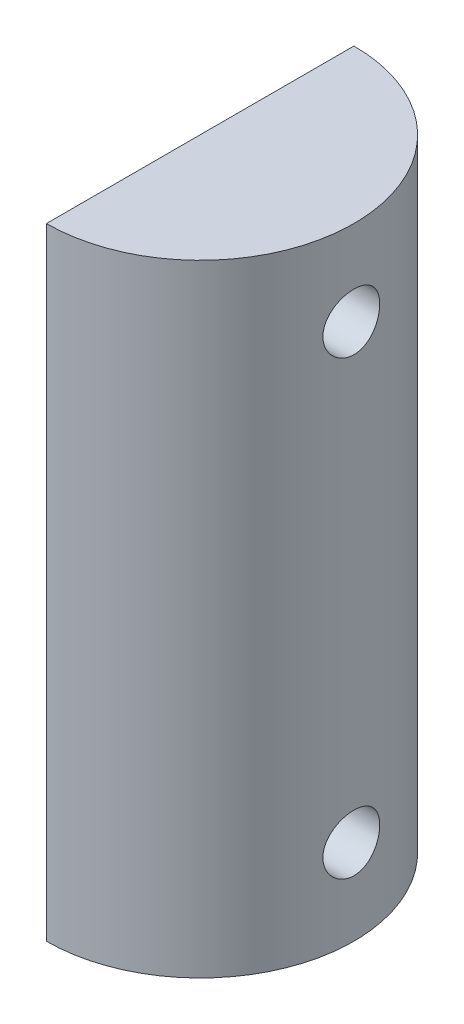
ISO-10303-21;
HEADER;
FILE_DESCRIPTION(('STEP AP214'),'2;1');
FILE_NAME('part.step','',(''),(''),'','','');
FILE_SCHEMA(('AUTOMOTIVE_DESIGN { 1 0 10303 214 1 1 1 1 }'));
ENDSEC;
DATA;
#1=APPLICATION_CONTEXT('core data for automotive mechanical design processes');
#2=APPLICATION_PROTOCOL_DEFINITION('international standard','automotive_design',2000,#1);
#3=PRODUCT_CONTEXT('',#1,'mechanical');
#4=PRODUCT('Part','Part','',(#3));
#5=PRODUCT_RELATED_PRODUCT_CATEGORY('part','',(#4));
#6=PRODUCT_DEFINITION_FORMATION('','',#4);
#7=PRODUCT_DEFINITION_CONTEXT('part definition',#1,'design');
#8=PRODUCT_DEFINITION('design','',#6,#7);
#9=PRODUCT_DEFINITION_SHAPE('','',#8);
#10=(LENGTH_UNIT() NAMED_UNIT(*) SI_UNIT(.MILLI.,.METRE.));
#11=(NAMED_UNIT(*) PLANE_ANGLE_UNIT() SI_UNIT($,.RADIAN.));
#12=(NAMED_UNIT(*) SI_UNIT($,.STERADIAN.) SOLID_ANGLE_UNIT());
#13=UNCERTAINTY_MEASURE_WITH_UNIT(LENGTH_MEASURE(1.E-05),#10,'distance_accuracy_value','');
#14=(GEOMETRIC_REPRESENTATION_CONTEXT(3) GLOBAL_UNCERTAINTY_ASSIGNED_CONTEXT((#13)) GLOBAL_UNIT_ASSIGNED_CONTEXT((#10,
#11,#12)) REPRESENTATION_CONTEXT('',''));
#15=CARTESIAN_POINT('',(0.,0.,0.));
#16=DIRECTION('',(0.,0.,1.));
#17=DIRECTION('',(1.,0.,0.));
#18=AXIS2_PLACEMENT_3D('',#15,#16,#17);
#19=CARTESIAN_POINT('',(0.,-131.3737,0.));
#20=DIRECTION('',(0.,1.,0.));
#21=DIRECTION('',(0.,0.,1.));
#22=AXIS2_PLACEMENT_3D('',#19,#20,#21);
#23=CYLINDRICAL_SURFACE('',#22,32.5);
#24=CARTESIAN_POINT('',(31.9413525073689,-18.,6.));
#25=CARTESIAN_POINT('',(31.9413510155267,-18.1670201057805,6.00000295853529));
#26=CARTESIAN_POINT('',(31.9426650102768,-18.3340018428286,5.99302407715924));
#27=CARTESIAN_POINT('',(31.9478791151134,-18.6668121386166,5.96516856930217));
#28=CARTESIAN_POINT('',(31.9517796989175,-18.8326404804968,5.94428939706712));
#29=CARTESIAN_POINT('',(31.9620573065449,-19.1619925142051,5.88877610738075));
#30=CARTESIAN_POINT('',(31.9684357545158,-19.3255148245342,5.85413407949497));
#31=CARTESIAN_POINT('',(31.9834845406126,-19.6490623611839,5.77135045100128));
#32=CARTESIAN_POINT('',(31.9921557212921,-19.8090862784299,5.72320388723111));
#33=CARTESIAN_POINT('',(32.0115246934935,-20.1242464901465,5.61385452206621));
#34=CARTESIAN_POINT('',(32.0222198341718,-20.2793888715672,5.55266878540925));
#35=CARTESIAN_POINT('',(32.0453420785026,-20.5839936382573,5.41763251250718));
#36=CARTESIAN_POINT('',(32.0577698204828,-20.7334539041662,5.34377730623473));
#37=CARTESIAN_POINT('',(32.0839962627161,-21.0255526297136,5.18398806674357));
#38=CARTESIAN_POINT('',(32.0977943188948,-21.1681942479849,5.09805970034271));
#39=CARTESIAN_POINT('',(32.1263856672193,-21.445828347411,4.91466745622354));
#40=CARTESIAN_POINT('',(32.1411793293463,-21.5808179502543,4.81719927981946));
#41=CARTESIAN_POINT('',(32.1715052735179,-21.8435609962047,4.61034548396163));
#42=CARTESIAN_POINT('',(32.1870436584928,-21.971224083592,4.5008459742891));
#43=CARTESIAN_POINT('',(32.2182832804324,-22.2169465370888,4.27148905640615));
#44=CARTESIAN_POINT('',(32.2339845755935,-22.3350023279637,4.15162782612188));
#45=CARTESIAN_POINT('',(32.2651012097674,-22.5606183411127,3.90243530466569));
#46=CARTESIAN_POINT('',(32.2805166335572,-22.6681817166419,3.77310687922168));
#47=CARTESIAN_POINT('',(32.3106427456994,-22.8721468919223,3.50577559302649));
#48=CARTESIAN_POINT('',(32.3253531722095,-22.9685445631812,3.36776955266252));
#49=CARTESIAN_POINT('',(32.3537527138724,-23.1500886784513,3.08306471017447));
#50=CARTESIAN_POINT('',(32.3674339230622,-23.2351512710868,2.93631162303768));
#51=CARTESIAN_POINT('',(32.3932768150282,-23.3926262624802,2.63597199364875));
#52=CARTESIAN_POINT('',(32.405437928495,-23.4650339257077,2.48238292019941));
#53=CARTESIAN_POINT('',(32.4278825976848,-23.596586679502,2.16955749285647));
#54=CARTESIAN_POINT('',(32.4381669640968,-23.6557374990927,2.01032361299022));
#55=CARTESIAN_POINT('',(32.4565759252547,-23.7603763163272,1.68728985940889));
#56=CARTESIAN_POINT('',(32.4646997333147,-23.805859338139,1.5234883464818));
#57=CARTESIAN_POINT('',(32.4852880303493,-23.9202900315319,1.03085331580681));
#58=CARTESIAN_POINT('',(32.4942588120657,-23.9688604255396,0.696870045496296));
#59=CARTESIAN_POINT('',(32.5017263371873,-24.0093733978569,0.0255664198837325));
#60=CARTESIAN_POINT('',(32.5002239463955,-24.0013206571241,-0.311753657266855));
#61=CARTESIAN_POINT('',(32.4870176310848,-23.9293779268632,-0.97605427828421));
#62=CARTESIAN_POINT('',(32.4754378068713,-23.8661671649283,-1.30311063675733));
#63=CARTESIAN_POINT('',(32.4435119174272,-23.6867559841587,-1.94188038235149));
#64=CARTESIAN_POINT('',(32.4231655399838,-23.5705536780706,-2.25359322258673));
#65=CARTESIAN_POINT('',(32.3757858792464,-23.2878119754776,-2.85482127182886));
#66=CARTESIAN_POINT('',(32.3487165042421,-23.1209997774601,-3.14420524520471));
#67=CARTESIAN_POINT('',(32.2908861364092,-22.7419728723981,-3.69112726413707));
#68=CARTESIAN_POINT('',(32.2601247793352,-22.5297536839487,-3.94866216241415));
#69=CARTESIAN_POINT('',(32.1977799600073,-22.0621897149659,-4.42860067861483));
#70=CARTESIAN_POINT('',(32.1661910748591,-21.8062506004133,-4.65042497033573));
#71=CARTESIAN_POINT('',(32.1061894073334,-21.2604949570635,-5.04808559706013));
#72=CARTESIAN_POINT('',(32.077776668672,-20.970677962086,-5.22392129912474));
#73=CARTESIAN_POINT('',(32.0273370970672,-20.3646393410768,-5.52477115699434));
#74=CARTESIAN_POINT('',(32.0053205950001,-20.0483760495226,-5.64970322536738));
#75=CARTESIAN_POINT('',(31.9703261346543,-19.3988509880879,-5.84449643174312));
#76=CARTESIAN_POINT('',(31.9573471859124,-19.0655910852348,-5.9143636046489));
#77=CARTESIAN_POINT('',(31.9420927158332,-18.3967510158392,-5.99620229168364));
#78=CARTESIAN_POINT('',(31.9396635072359,-18.0612759774973,-6.00900518397556));
#79=CARTESIAN_POINT('',(31.9453725765504,-17.3929810182009,-5.9785785831626));
#80=CARTESIAN_POINT('',(31.9535103486703,-17.0601609709315,-5.93535177193744));
#81=CARTESIAN_POINT('',(31.979293465026,-16.4093432915108,-5.79480586142508));
#82=CARTESIAN_POINT('',(31.9968624934417,-16.0912486424835,-5.69792075735497));
#83=CARTESIAN_POINT('',(32.0394630353324,-15.4758079669587,-5.45326809850266));
#84=CARTESIAN_POINT('',(32.0644950840986,-15.1784634306683,-5.30549689375586));
#85=CARTESIAN_POINT('',(32.1195522144905,-14.6092954141647,-4.96134651750512));
#86=CARTESIAN_POINT('',(32.1496301190139,-14.3377953660428,-4.76444105467971));
#87=CARTESIAN_POINT('',(32.2112404635557,-13.8313897261277,-4.328321885264));
#88=CARTESIAN_POINT('',(32.2427730300079,-13.5964873230619,-4.08910449593802));
#89=CARTESIAN_POINT('',(32.3042327039953,-13.1668487984119,-3.57144762775752));
#90=CARTESIAN_POINT('',(32.3341337897011,-12.9726711361731,-3.29254111714154));
#91=CARTESIAN_POINT('',(32.3885259688709,-12.6339325863055,-2.70556807005942));
#92=CARTESIAN_POINT('',(32.4130172660944,-12.4893698298182,-2.39750263248843));
#93=CARTESIAN_POINT('',(32.453720812997,-12.2548001775852,-1.76258072681928));
#94=CARTESIAN_POINT('',(32.4699750052543,-12.1645164504713,-1.435829080217));
#95=CARTESIAN_POINT('',(32.4925422562138,-12.0402027598243,-0.77128467597163));
#96=CARTESIAN_POINT('',(32.4988563275773,-12.0061670659399,-0.43349304661908));
#97=CARTESIAN_POINT('',(32.5003540565631,-11.9980959848788,0.0710321096354896));
#98=CARTESIAN_POINT('',(32.4995572690841,-12.0023921897452,0.237682638844528));
#99=CARTESIAN_POINT('',(32.495424432952,-12.0248200641111,0.570001473574037));
#100=CARTESIAN_POINT('',(32.4920893427311,-12.0429465114863,0.735670126050066));
#101=CARTESIAN_POINT('',(32.4829668638015,-12.0929088068172,1.06490505616126));
#102=CARTESIAN_POINT('',(32.4771786148997,-12.1247494636854,1.22847057559066));
#103=CARTESIAN_POINT('',(32.4633144843585,-12.2018772460574,1.55224085017754));
#104=CARTESIAN_POINT('',(32.4552394235426,-12.2471595471253,1.71244678909537));
#105=CARTESIAN_POINT('',(32.4370355937856,-12.3507635833937,2.02822736208988));
#106=CARTESIAN_POINT('',(32.4269095551274,-12.4090679939145,2.18380784113108));
#107=CARTESIAN_POINT('',(32.4048786716608,-12.5382959094409,2.48943892302125));
#108=CARTESIAN_POINT('',(32.3929744609303,-12.6092149179221,2.63949147339193));
#109=CARTESIAN_POINT('',(32.3677035827214,-12.7632067767066,2.9331721059094));
#110=CARTESIAN_POINT('',(32.3543363286126,-12.8462845067763,3.07679757825834));
#111=CARTESIAN_POINT('',(32.326510815552,-13.0239579793895,3.35655401432149));
#112=CARTESIAN_POINT('',(32.3120529366048,-13.118549717111,3.49268756010242));
#113=CARTESIAN_POINT('',(32.2822211930687,-13.3200564389901,3.75850222746007));
#114=CARTESIAN_POINT('',(32.2668371982912,-13.427128074562,3.88806348648546));
#115=CARTESIAN_POINT('',(32.2357777361537,-13.6516986066352,4.1376867350828));
#116=CARTESIAN_POINT('',(32.2201023739441,-13.7691937970361,4.25775207244292));
#117=CARTESIAN_POINT('',(32.188881874074,-14.0139179927548,4.48768949162614));
#118=CARTESIAN_POINT('',(32.1733368199346,-14.1411527795317,4.59755543208626));
#119=CARTESIAN_POINT('',(32.1428277311297,-14.4043839559098,4.8062192058397));
#120=CARTESIAN_POINT('',(32.1278634847102,-14.540377103324,4.9050210981696));
#121=CARTESIAN_POINT('',(32.0987973355248,-14.8215537726137,5.09178042683274));
#122=CARTESIAN_POINT('',(32.084704774444,-14.9668111641444,5.17962815718121));
#123=CARTESIAN_POINT('',(32.0579500798171,-15.2642919089007,5.34272083193666));
#124=CARTESIAN_POINT('',(32.0452874201016,-15.4165126706109,5.41797041710961));
#125=CARTESIAN_POINT('',(32.0217661734497,-15.7268057270561,5.55529909721156));
#126=CARTESIAN_POINT('',(32.0109064112641,-15.8848741270677,5.61738677931814));
#127=CARTESIAN_POINT('',(31.9913049603576,-16.2057703702512,5.72796202752485));
#128=CARTESIAN_POINT('',(31.9825628397174,-16.3685972352697,5.7764523672906));
#129=CARTESIAN_POINT('',(31.9640370171761,-16.7725384169445,5.87827970156251));
#130=CARTESIAN_POINT('',(31.9555746068072,-17.0157118039164,5.92386631533028));
#131=CARTESIAN_POINT('',(31.9442335268558,-17.5059514948419,5.98472388662139));
#132=CARTESIAN_POINT('',(31.9413547134423,-17.753017698353,5.99999562504256));
#133=CARTESIAN_POINT('',(31.9413525073689,-18.,6.));
#134=B_SPLINE_CURVE_WITH_KNOTS('',3,(#24,#25,#26,#27,#28,#29,#30,#31,#32,#33,#34,#35,#36,#37,
#38,#39,#40,#41,#42,#43,#44,#45,#46,#47,#48,#49,#50,#51,#52,#53,#54,#55,#56,#57,#58,#59,#60,#61,
#62,#63,#64,#65,#66,#67,#68,#69,#70,#71,#72,#73,#74,#75,#76,#77,#78,#79,#80,#81,#82,#83,#84,#85,
#86,#87,#88,#89,#90,#91,#92,#93,#94,#95,#96,#97,#98,#99,#100,#101,#102,#103,#104,#105,#106,#107,
#108,#109,#110,#111,#112,#113,#114,#115,#116,#117,#118,#119,#120,#121,#122,#123,#124,#125,#126,
#127,#128,#129,#130,#131,#132,#133),.UNSPECIFIED.,.T.,.F.,(4,2,2,2,2,2,2,2,2,2,2,2,2,2,2,2,2,2,
2,2,2,2,2,2,2,2,2,2,2,2,2,2,2,2,2,2,2,2,2,2,2,2,2,2,2,2,2,2,2,2,2,2,2,2,4),(0.,0.50084346333139,
1.00177867835029,1.50300223188231,2.00441023608585,2.50516601956036,3.00610678220385,
3.50681319732149,4.00770672054381,4.51383441416538,5.02014960364326,5.52631215984352,
6.03266127501114,6.54256967053899,7.05266846938636,7.56254639910262,8.07260972824402,
9.08012563787736,10.087558258518,11.082757472296,12.0779921321037,13.0786896815496,
14.0794860395937,15.0951637423725,16.1108554231421,17.128178591491,18.1453902495802,
19.1477325069965,20.1500267887514,21.144330335666,22.1387052169703,23.1442262843942,
24.1498349132333,25.1684425209453,26.1870117562707,27.2003410634462,28.2135671298398,
28.7132031034217,29.2126505140953,29.7122731996682,30.2117167784931,30.7104998117235,
31.2091054067347,31.7079116630686,32.2065449168668,32.7122968113089,33.217869600612,
33.7237448623406,34.2294339227625,34.7398381371698,35.2500539188164,35.7599357905253,
36.269713577754,37.0103588870579,37.7509851174174),.UNSPECIFIED.);
#135=CARTESIAN_POINT('',(31.9413525073689,-18.,6.));
#136=VERTEX_POINT('',#135);
#137=EDGE_CURVE('E72',#136,#136,#134,.T.);
#138=ORIENTED_EDGE('',*,*,#137,.F.);
#139=EDGE_LOOP('',(#138));
#140=FACE_BOUND('',#139,.T.);
#141=CARTESIAN_POINT('',(31.9413525073689,-113.3737,6.));
#142=CARTESIAN_POINT('',(31.9413510155267,-113.540720105781,6.00000295853529));
#143=CARTESIAN_POINT('',(31.9426650102768,-113.707701842829,5.99302407715925));
#144=CARTESIAN_POINT('',(31.9478791151134,-114.040512138617,5.96516856930217));
#145=CARTESIAN_POINT('',(31.9517796989175,-114.206340480497,5.94428939706712));
#146=CARTESIAN_POINT('',(31.9620573065449,-114.535692514205,5.88877610738074));
#147=CARTESIAN_POINT('',(31.9684357545158,-114.699214824534,5.85413407949497));
#148=CARTESIAN_POINT('',(31.9834845406126,-115.022762361184,5.77135045100128));
#149=CARTESIAN_POINT('',(31.9921557212921,-115.18278627843,5.72320388723111));
#150=CARTESIAN_POINT('',(32.0115246934935,-115.497946490147,5.61385452206621));
#151=CARTESIAN_POINT('',(32.0222198341718,-115.653088871567,5.55266878540925));
#152=CARTESIAN_POINT('',(32.0453420785026,-115.957693638257,5.41763251250718));
#153=CARTESIAN_POINT('',(32.0577698204828,-116.107153904166,5.34377730623473));
#154=CARTESIAN_POINT('',(32.0839962627161,-116.399252629714,5.18398806674357));
#155=CARTESIAN_POINT('',(32.0977943188948,-116.541894247985,5.09805970034271));
#156=CARTESIAN_POINT('',(32.1263856672193,-116.819528347411,4.91466745622354));
#157=CARTESIAN_POINT('',(32.1411793293463,-116.954517950254,4.81719927981946));
#158=CARTESIAN_POINT('',(32.1715052735179,-117.217260996205,4.61034548396164));
#159=CARTESIAN_POINT('',(32.1870436584928,-117.344924083592,4.5008459742891));
#160=CARTESIAN_POINT('',(32.2182832804324,-117.590646537089,4.27148905640615));
#161=CARTESIAN_POINT('',(32.2339845755935,-117.708702327964,4.15162782612188));
#162=CARTESIAN_POINT('',(32.2651012097674,-117.934318341113,3.90243530466569));
#163=CARTESIAN_POINT('',(32.2805166335572,-118.041881716642,3.77310687922168));
#164=CARTESIAN_POINT('',(32.3106427456994,-118.245846891922,3.50577559302649));
#165=CARTESIAN_POINT('',(32.3253531722095,-118.342244563181,3.36776955266252));
#166=CARTESIAN_POINT('',(32.3537527138724,-118.523788678451,3.08306471017448));
#167=CARTESIAN_POINT('',(32.3674339230622,-118.608851271087,2.93631162303769));
#168=CARTESIAN_POINT('',(32.3932768150282,-118.76632626248,2.63597199364876));
#169=CARTESIAN_POINT('',(32.405437928495,-118.838733925708,2.48238292019942));
#170=CARTESIAN_POINT('',(32.4278825976848,-118.970286679502,2.16955749285648));
#171=CARTESIAN_POINT('',(32.4381669640968,-119.029437499093,2.01032361299022));
#172=CARTESIAN_POINT('',(32.4565759252547,-119.134076316327,1.6872898594089));
#173=CARTESIAN_POINT('',(32.4646997333147,-119.179559338139,1.5234883464818));
#174=CARTESIAN_POINT('',(32.4852880303492,-119.293990031532,1.03085331580681));
#175=CARTESIAN_POINT('',(32.4942588120657,-119.34256042554,0.6968700454963));
#176=CARTESIAN_POINT('',(32.5017263371873,-119.383073397857,0.0255664198837362));
#177=CARTESIAN_POINT('',(32.5002239463955,-119.375020657124,-0.311753657266851));
#178=CARTESIAN_POINT('',(32.4870176310848,-119.303077926863,-0.976054278284207));
#179=CARTESIAN_POINT('',(32.4754378068713,-119.239867164928,-1.30311063675733));
#180=CARTESIAN_POINT('',(32.4435119174272,-119.060455984159,-1.94188038235149));
#181=CARTESIAN_POINT('',(32.4231655399838,-118.944253678071,-2.25359322258673));
#182=CARTESIAN_POINT('',(32.3757858792464,-118.661511975478,-2.85482127182886));
#183=CARTESIAN_POINT('',(32.3487165042421,-118.49469977746,-3.14420524520471));
#184=CARTESIAN_POINT('',(32.2908861364092,-118.115672872398,-3.69112726413707));
#185=CARTESIAN_POINT('',(32.2601247793352,-117.903453683949,-3.94866216241415));
#186=CARTESIAN_POINT('',(32.1977799600073,-117.435889714966,-4.42860067861483));
#187=CARTESIAN_POINT('',(32.1661910748591,-117.179950600413,-4.65042497033573));
#188=CARTESIAN_POINT('',(32.1061894073334,-116.634194957064,-5.04808559706013));
#189=CARTESIAN_POINT('',(32.077776668672,-116.344377962086,-5.22392129912474));
#190=CARTESIAN_POINT('',(32.0273370970672,-115.738339341077,-5.52477115699434));
#191=CARTESIAN_POINT('',(32.0053205950001,-115.422076049523,-5.64970322536738));
#192=CARTESIAN_POINT('',(31.9703261346543,-114.772550988088,-5.84449643174312));
#193=CARTESIAN_POINT('',(31.9573471859124,-114.439291085235,-5.9143636046489));
#194=CARTESIAN_POINT('',(31.9420927158332,-113.770451015839,-5.99620229168364));
#195=CARTESIAN_POINT('',(31.9396635072359,-113.434975977497,-6.00900518397556));
#196=CARTESIAN_POINT('',(31.9453725765504,-112.766681018201,-5.97857858316261));
#197=CARTESIAN_POINT('',(31.9535103486703,-112.433860970932,-5.93535177193744));
#198=CARTESIAN_POINT('',(31.979293465026,-111.783043291511,-5.79480586142508));
#199=CARTESIAN_POINT('',(31.9968624934417,-111.464948642484,-5.69792075735497));
#200=CARTESIAN_POINT('',(32.0394630353324,-110.849507966959,-5.45326809850266));
#201=CARTESIAN_POINT('',(32.0644950840986,-110.552163430668,-5.30549689375586));
#202=CARTESIAN_POINT('',(32.1195522144905,-109.982995414165,-4.96134651750512));
#203=CARTESIAN_POINT('',(32.1496301190139,-109.711495366043,-4.7644410546797));
#204=CARTESIAN_POINT('',(32.2112404635557,-109.205089726128,-4.328321885264));
#205=CARTESIAN_POINT('',(32.2427730300079,-108.970187323062,-4.08910449593802));
#206=CARTESIAN_POINT('',(32.3042327039953,-108.540548798412,-3.57144762775753));
#207=CARTESIAN_POINT('',(32.3341337897011,-108.346371136173,-3.29254111714154));
#208=CARTESIAN_POINT('',(32.3885259688709,-108.007632586305,-2.70556807005942));
#209=CARTESIAN_POINT('',(32.4130172660944,-107.863069829818,-2.39750263248843));
#210=CARTESIAN_POINT('',(32.453720812997,-107.628500177585,-1.76258072681928));
#211=CARTESIAN_POINT('',(32.4699750052543,-107.538216450471,-1.435829080217));
#212=CARTESIAN_POINT('',(32.4925422562138,-107.413902759824,-0.771284675971633));
#213=CARTESIAN_POINT('',(32.4988563275773,-107.37986706594,-0.433493046619083));
#214=CARTESIAN_POINT('',(32.5003540565631,-107.371795984879,0.0710321096354869));
#215=CARTESIAN_POINT('',(32.4995572690841,-107.376092189745,0.237682638844525));
#216=CARTESIAN_POINT('',(32.495424432952,-107.398520064111,0.570001473574034));
#217=CARTESIAN_POINT('',(32.4920893427311,-107.416646511486,0.735670126050064));
#218=CARTESIAN_POINT('',(32.4829668638015,-107.466608806817,1.06490505616126));
#219=CARTESIAN_POINT('',(32.4771786148997,-107.498449463685,1.22847057559065));
#220=CARTESIAN_POINT('',(32.4633144843585,-107.575577246057,1.55224085017753));
#221=CARTESIAN_POINT('',(32.4552394235426,-107.620859547125,1.71244678909536));
#222=CARTESIAN_POINT('',(32.4370355937856,-107.724463583394,2.02822736208988));
#223=CARTESIAN_POINT('',(32.4269095551274,-107.782767993915,2.18380784113108));
#224=CARTESIAN_POINT('',(32.4048786716608,-107.911995909441,2.48943892302125));
#225=CARTESIAN_POINT('',(32.3929744609303,-107.982914917922,2.63949147339193));
#226=CARTESIAN_POINT('',(32.3677035827214,-108.136906776707,2.9331721059094));
#227=CARTESIAN_POINT('',(32.3543363286126,-108.219984506776,3.07679757825834));
#228=CARTESIAN_POINT('',(32.326510815552,-108.39765797939,3.35655401432149));
#229=CARTESIAN_POINT('',(32.3120529366048,-108.492249717111,3.49268756010242));
#230=CARTESIAN_POINT('',(32.2822211930687,-108.69375643899,3.75850222746007));
#231=CARTESIAN_POINT('',(32.2668371982912,-108.800828074562,3.88806348648546));
#232=CARTESIAN_POINT('',(32.2357777361537,-109.025398606635,4.1376867350828));
#233=CARTESIAN_POINT('',(32.2201023739441,-109.142893797036,4.25775207244293));
#234=CARTESIAN_POINT('',(32.188881874074,-109.387617992755,4.48768949162615));
#235=CARTESIAN_POINT('',(32.1733368199346,-109.514852779532,4.59755543208626));
#236=CARTESIAN_POINT('',(32.1428277311297,-109.77808395591,4.8062192058397));
#237=CARTESIAN_POINT('',(32.1278634847102,-109.914077103324,4.90502109816961));
#238=CARTESIAN_POINT('',(32.0987973355248,-110.195253772614,5.09178042683274));
#239=CARTESIAN_POINT('',(32.084704774444,-110.340511164144,5.17962815718121));
#240=CARTESIAN_POINT('',(32.0579500798171,-110.637991908901,5.34272083193665));
#241=CARTESIAN_POINT('',(32.0452874201016,-110.790212670611,5.4179704171096));
#242=CARTESIAN_POINT('',(32.0217661734497,-111.100505727056,5.55529909721155));
#243=CARTESIAN_POINT('',(32.0109064112641,-111.258574127068,5.61738677931813));
#244=CARTESIAN_POINT('',(31.9913049603576,-111.579470370251,5.72796202752485));
#245=CARTESIAN_POINT('',(31.9825628397174,-111.74229723527,5.77645236729059));
#246=CARTESIAN_POINT('',(31.9640370171761,-112.146238416944,5.87827970156251));
#247=CARTESIAN_POINT('',(31.9555746068072,-112.389411803916,5.92386631533028));
#248=CARTESIAN_POINT('',(31.9442335268558,-112.879651494842,5.98472388662139));
#249=CARTESIAN_POINT('',(31.9413547134423,-113.126717698353,5.99999562504256));
#250=CARTESIAN_POINT('',(31.9413525073689,-113.3737,6.));
#251=B_SPLINE_CURVE_WITH_KNOTS('',3,(#141,#142,#143,#144,#145,#146,#147,#148,#149,#150,#151,
#152,#153,#154,#155,#156,#157,#158,#159,#160,#161,#162,#163,#164,#165,#166,#167,#168,#169,#170,
#171,#172,#173,#174,#175,#176,#177,#178,#179,#180,#181,#182,#183,#184,#185,#186,#187,#188,#189,
#190,#191,#192,#193,#194,#195,#196,#197,#198,#199,#200,#201,#202,#203,#204,#205,#206,#207,#208,
#209,#210,#211,#212,#213,#214,#215,#216,#217,#218,#219,#220,#221,#222,#223,#224,#225,#226,#227,
#228,#229,#230,#231,#232,#233,#234,#235,#236,#237,#238,#239,#240,#241,#242,#243,#244,#245,#246,
#247,#248,#249,#250),.UNSPECIFIED.,.T.,.F.,(4,2,2,2,2,2,2,2,2,2,2,2,2,2,2,2,2,2,2,2,2,2,2,2,2,2,
2,2,2,2,2,2,2,2,2,2,2,2,2,2,2,2,2,2,2,2,2,2,2,2,2,2,2,2,4),(0.,0.500843463331397,
1.0017786783503,1.5030022318823,2.00441023608585,2.50516601956037,3.00610678220385,
3.50681319732149,4.00770672054381,4.51383441416538,5.02014960364326,5.52631215984352,
6.03266127501114,6.54256967053899,7.05266846938635,7.56254639910262,8.07260972824401,
9.08012563787735,10.087558258518,11.0827574722959,12.0779921321037,13.0786896815496,
14.0794860395937,15.0951637423724,16.1108554231421,17.128178591491,18.1453902495802,
19.1477325069965,20.1500267887514,21.144330335666,22.1387052169704,23.1442262843942,
24.1498349132333,25.1684425209453,26.1870117562707,27.2003410634462,28.2135671298398,
28.7132031034217,29.2126505140953,29.7122731996682,30.2117167784931,30.7104998117235,
31.2091054067347,31.7079116630686,32.2065449168668,32.7122968113089,33.217869600612,
33.7237448623406,34.2294339227624,34.7398381371698,35.2500539188164,35.7599357905253,
36.269713577754,37.0103588870579,37.7509851174174),.UNSPECIFIED.);
#252=CARTESIAN_POINT('',(31.9413525073689,-113.3737,6.));
#253=VERTEX_POINT('',#252);
#254=EDGE_CURVE('E86',#253,#253,#251,.T.);
#255=ORIENTED_EDGE('',*,*,#254,.F.);
#256=EDGE_LOOP('',(#255));
#257=FACE_BOUND('',#256,.T.);
#258=CARTESIAN_POINT('',(0.,0.,0.));
#259=DIRECTION('',(0.,1.,0.));
#260=DIRECTION('',(0.,0.,1.));
#261=AXIS2_PLACEMENT_3D('',#258,#259,#260);
#262=CIRCLE('',#261,32.5);
#263=CARTESIAN_POINT('',(0.,0.,32.5));
#264=VERTEX_POINT('',#263);
#265=CARTESIAN_POINT('',(0.,0.,-32.5));
#266=VERTEX_POINT('',#265);
#267=EDGE_CURVE('E70',#264,#266,#262,.T.);
#268=ORIENTED_EDGE('',*,*,#267,.F.);
#269=DIRECTION('',(0.,1.,0.));
#270=VECTOR('',#269,1.);
#271=CARTESIAN_POINT('',(0.,-131.3737,32.5));
#272=LINE('',#271,#270);
#273=CARTESIAN_POINT('',(0.,-131.3737,32.5));
#274=VERTEX_POINT('',#273);
#275=EDGE_CURVE('E11',#274,#264,#272,.T.);
#276=ORIENTED_EDGE('',*,*,#275,.F.);
#277=CARTESIAN_POINT('',(0.,-131.3737,0.));
#278=DIRECTION('',(0.,1.,0.));
#279=DIRECTION('',(0.,0.,1.));
#280=AXIS2_PLACEMENT_3D('',#277,#278,#279);
#281=CIRCLE('',#280,32.5);
#282=CARTESIAN_POINT('',(0.,-131.3737,-32.5));
#283=VERTEX_POINT('',#282);
#284=EDGE_CURVE('E75',#274,#283,#281,.T.);
#285=ORIENTED_EDGE('',*,*,#284,.T.);
#286=DIRECTION('',(0.,1.,0.));
#287=VECTOR('',#286,1.);
#288=CARTESIAN_POINT('',(0.,-131.3737,-32.5));
#289=LINE('',#288,#287);
#290=EDGE_CURVE('E44',#283,#266,#289,.T.);
#291=ORIENTED_EDGE('',*,*,#290,.T.);
#292=EDGE_LOOP('',(#268,#276,#285,#291));
#293=FACE_BOUND('',#292,.T.);
#294=ADVANCED_FACE('F40',(#140,#257,#293),#23,.T.);
#295=CARTESIAN_POINT('',(0.,-131.3737,0.));
#296=DIRECTION('',(-1.,0.,0.));
#297=DIRECTION('',(0.,0.,1.));
#298=AXIS2_PLACEMENT_3D('',#295,#296,#297);
#299=PLANE('',#298);
#300=CARTESIAN_POINT('',(0.,-18.,0.));
#301=DIRECTION('',(-1.,0.,0.));
#302=DIRECTION('',(0.,0.,1.));
#303=AXIS2_PLACEMENT_3D('',#300,#301,#302);
#304=CIRCLE('',#303,6.);
#305=CARTESIAN_POINT('',(0.,-18.,6.));
#306=VERTEX_POINT('',#305);
#307=EDGE_CURVE('E115',#306,#306,#304,.T.);
#308=ORIENTED_EDGE('',*,*,#307,.F.);
#309=EDGE_LOOP('',(#308));
#310=FACE_BOUND('',#309,.T.);
#311=CARTESIAN_POINT('',(0.,-113.3737,0.));
#312=DIRECTION('',(-1.,0.,0.));
#313=DIRECTION('',(0.,0.,1.));
#314=AXIS2_PLACEMENT_3D('',#311,#312,#313);
#315=CIRCLE('',#314,6.);
#316=CARTESIAN_POINT('',(0.,-113.3737,6.));
#317=VERTEX_POINT('',#316);
#318=EDGE_CURVE('E118',#317,#317,#315,.T.);
#319=ORIENTED_EDGE('',*,*,#318,.F.);
#320=EDGE_LOOP('',(#319));
#321=FACE_BOUND('',#320,.T.);
#322=DIRECTION('',(0.,0.,1.));
#323=VECTOR('',#322,1.);
#324=CARTESIAN_POINT('',(0.,0.,0.));
#325=LINE('',#324,#323);
#326=EDGE_CURVE('E67',#266,#264,#325,.T.);
#327=ORIENTED_EDGE('',*,*,#326,.F.);
#328=ORIENTED_EDGE('',*,*,#290,.F.);
#329=DIRECTION('',(0.,0.,1.));
#330=VECTOR('',#329,1.);
#331=CARTESIAN_POINT('',(0.,-131.3737,0.));
#332=LINE('',#331,#330);
#333=EDGE_CURVE('E69',#283,#274,#332,.T.);
#334=ORIENTED_EDGE('',*,*,#333,.T.);
#335=ORIENTED_EDGE('',*,*,#275,.T.);
#336=EDGE_LOOP('',(#327,#328,#334,#335));
#337=FACE_BOUND('',#336,.T.);
#338=ADVANCED_FACE('F65',(#310,#321,#337),#299,.T.);
#339=CARTESIAN_POINT('',(0.,-131.3737,0.));
#340=DIRECTION('',(0.,1.,0.));
#341=DIRECTION('',(0.,0.,1.));
#342=AXIS2_PLACEMENT_3D('',#339,#340,#341);
#343=PLANE('',#342);
#344=ORIENTED_EDGE('',*,*,#284,.F.);
#345=ORIENTED_EDGE('',*,*,#333,.F.);
#346=EDGE_LOOP('',(#344,#345));
#347=FACE_BOUND('',#346,.T.);
#348=ADVANCED_FACE('F101',(#347),#343,.F.);
#349=CARTESIAN_POINT('',(0.,0.,0.));
#350=DIRECTION('',(0.,1.,0.));
#351=DIRECTION('',(0.,0.,1.));
#352=AXIS2_PLACEMENT_3D('',#349,#350,#351);
#353=PLANE('',#352);
#354=ORIENTED_EDGE('',*,*,#267,.T.);
#355=ORIENTED_EDGE('',*,*,#326,.T.);
#356=EDGE_LOOP('',(#354,#355));
#357=FACE_BOUND('',#356,.T.);
#358=ADVANCED_FACE('F74',(#357),#353,.T.);
#359=CARTESIAN_POINT('',(59.,-113.3737,0.));
#360=DIRECTION('',(-1.,0.,0.));
#361=DIRECTION('',(0.,0.,1.));
#362=AXIS2_PLACEMENT_3D('',#359,#360,#361);
#363=CYLINDRICAL_SURFACE('',#362,6.);
#364=ORIENTED_EDGE('',*,*,#254,.T.);
#365=EDGE_LOOP('',(#364));
#366=FACE_BOUND('',#365,.T.);
#367=ORIENTED_EDGE('',*,*,#318,.T.);
#368=EDGE_LOOP('',(#367));
#369=FACE_BOUND('',#368,.T.);
#370=ADVANCED_FACE('F95',(#366,#369),#363,.F.);
#371=CARTESIAN_POINT('',(59.,-18.,0.));
#372=DIRECTION('',(-1.,0.,0.));
#373=DIRECTION('',(0.,0.,1.));
#374=AXIS2_PLACEMENT_3D('',#371,#372,#373);
#375=CYLINDRICAL_SURFACE('',#374,6.);
#376=ORIENTED_EDGE('',*,*,#137,.T.);
#377=EDGE_LOOP('',(#376));
#378=FACE_BOUND('',#377,.T.);
#379=ORIENTED_EDGE('',*,*,#307,.T.);
#380=EDGE_LOOP('',(#379));
#381=FACE_BOUND('',#380,.T.);
#382=ADVANCED_FACE('F92',(#378,#381),#375,.F.);
#383=CLOSED_SHELL('',(#294,#338,#348,#358,#370,#382));
#384=MANIFOLD_SOLID_BREP('B2',#383);
#385=ADVANCED_BREP_SHAPE_REPRESENTATION('',(#18,#384),#14);
#386=SHAPE_DEFINITION_REPRESENTATION(#9,#385);
ENDSEC;
END-ISO-10303-21;
